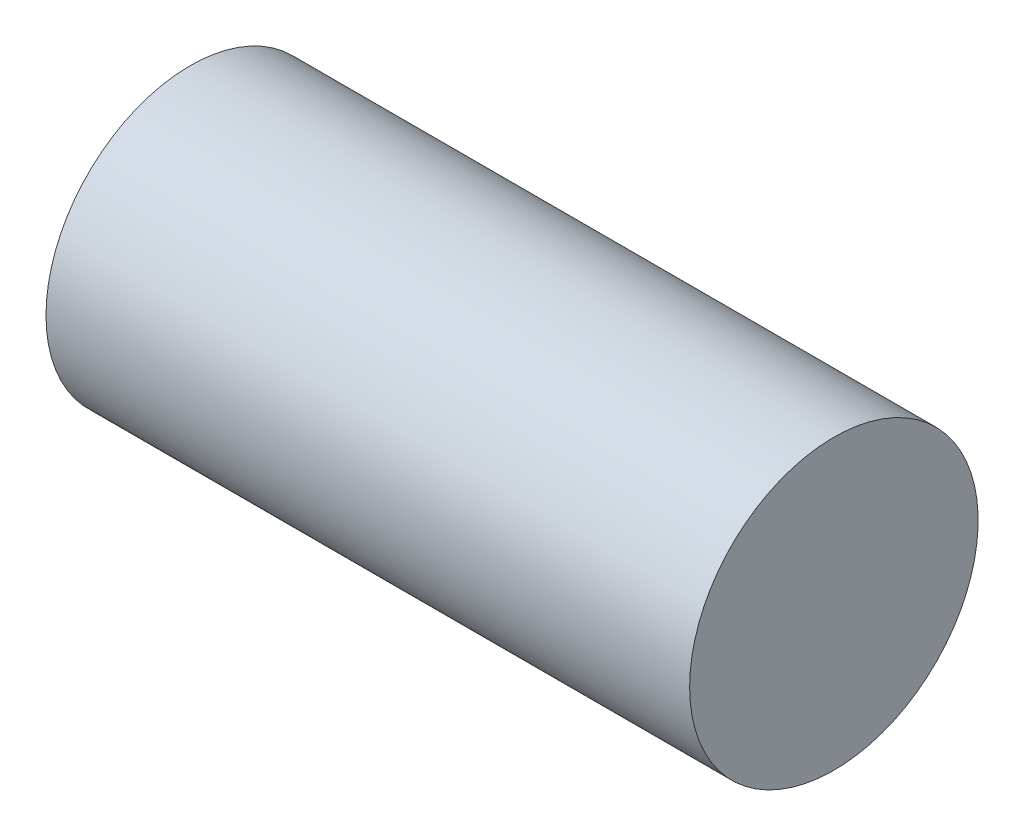
ISO-10303-21;
HEADER;
FILE_DESCRIPTION(('STEP AP214'),'2;1');
FILE_NAME('part.step','',(''),(''),'','','');
FILE_SCHEMA(('AUTOMOTIVE_DESIGN { 1 0 10303 214 1 1 1 1 }'));
ENDSEC;
DATA;
#1=APPLICATION_CONTEXT('core data for automotive mechanical design processes');
#2=APPLICATION_PROTOCOL_DEFINITION('international standard','automotive_design',2000,#1);
#3=PRODUCT_CONTEXT('',#1,'mechanical');
#4=PRODUCT('Part','Part','',(#3));
#5=PRODUCT_RELATED_PRODUCT_CATEGORY('part','',(#4));
#6=PRODUCT_DEFINITION_FORMATION('','',#4);
#7=PRODUCT_DEFINITION_CONTEXT('part definition',#1,'design');
#8=PRODUCT_DEFINITION('design','',#6,#7);
#9=PRODUCT_DEFINITION_SHAPE('','',#8);
#10=(LENGTH_UNIT() NAMED_UNIT(*) SI_UNIT(.MILLI.,.METRE.));
#11=(NAMED_UNIT(*) PLANE_ANGLE_UNIT() SI_UNIT($,.RADIAN.));
#12=(NAMED_UNIT(*) SI_UNIT($,.STERADIAN.) SOLID_ANGLE_UNIT());
#13=UNCERTAINTY_MEASURE_WITH_UNIT(LENGTH_MEASURE(1.E-05),#10,'distance_accuracy_value','');
#14=(GEOMETRIC_REPRESENTATION_CONTEXT(3) GLOBAL_UNCERTAINTY_ASSIGNED_CONTEXT((#13)) GLOBAL_UNIT_ASSIGNED_CONTEXT((#10,
#11,#12)) REPRESENTATION_CONTEXT('',''));
#15=CARTESIAN_POINT('',(0.,0.,0.));
#16=DIRECTION('',(0.,0.,1.));
#17=DIRECTION('',(1.,0.,0.));
#18=AXIS2_PLACEMENT_3D('',#15,#16,#17);
#19=CARTESIAN_POINT('',(0.,0.,0.));
#20=DIRECTION('',(-1.,0.,0.));
#21=DIRECTION('',(0.,0.,1.));
#22=AXIS2_PLACEMENT_3D('',#19,#20,#21);
#23=PLANE('',#22);
#24=CARTESIAN_POINT('',(0.,0.,-13.));
#25=DIRECTION('',(-1.,0.,0.));
#26=DIRECTION('',(0.,0.,1.));
#27=AXIS2_PLACEMENT_3D('',#24,#25,#26);
#28=CIRCLE('',#27,13.);
#29=CARTESIAN_POINT('',(0.,0.,0.));
#30=VERTEX_POINT('',#29);
#31=EDGE_CURVE('E38',#30,#30,#28,.T.);
#32=ORIENTED_EDGE('',*,*,#31,.T.);
#33=EDGE_LOOP('',(#32));
#34=FACE_BOUND('',#33,.T.);
#35=ADVANCED_FACE('F32',(#34),#23,.T.);
#36=CARTESIAN_POINT('',(58.,0.,0.));
#37=DIRECTION('',(1.,0.,0.));
#38=DIRECTION('',(0.,0.,-1.));
#39=AXIS2_PLACEMENT_3D('',#36,#37,#38);
#40=PLANE('',#39);
#41=CARTESIAN_POINT('',(58.,0.,-13.));
#42=DIRECTION('',(-1.,0.,0.));
#43=DIRECTION('',(0.,0.,1.));
#44=AXIS2_PLACEMENT_3D('',#41,#42,#43);
#45=CIRCLE('',#44,13.);
#46=CARTESIAN_POINT('',(58.,0.,0.));
#47=VERTEX_POINT('',#46);
#48=EDGE_CURVE('E10',#47,#47,#45,.T.);
#49=ORIENTED_EDGE('',*,*,#48,.F.);
#50=EDGE_LOOP('',(#49));
#51=FACE_BOUND('',#50,.T.);
#52=ADVANCED_FACE('F47',(#51),#40,.T.);
#53=CARTESIAN_POINT('',(0.,0.,-13.));
#54=DIRECTION('',(-1.,0.,0.));
#55=DIRECTION('',(0.,0.,1.));
#56=AXIS2_PLACEMENT_3D('',#53,#54,#55);
#57=CYLINDRICAL_SURFACE('',#56,13.);
#58=ORIENTED_EDGE('',*,*,#48,.T.);
#59=EDGE_LOOP('',(#58));
#60=FACE_BOUND('',#59,.T.);
#61=ORIENTED_EDGE('',*,*,#31,.F.);
#62=EDGE_LOOP('',(#61));
#63=FACE_BOUND('',#62,.T.);
#64=ADVANCED_FACE('F45',(#60,#63),#57,.T.);
#65=CLOSED_SHELL('',(#35,#52,#64));
#66=MANIFOLD_SOLID_BREP('B2',#65);
#67=ADVANCED_BREP_SHAPE_REPRESENTATION('',(#18,#66),#14);
#68=SHAPE_DEFINITION_REPRESENTATION(#9,#67);
ENDSEC;
END-ISO-10303-21;
